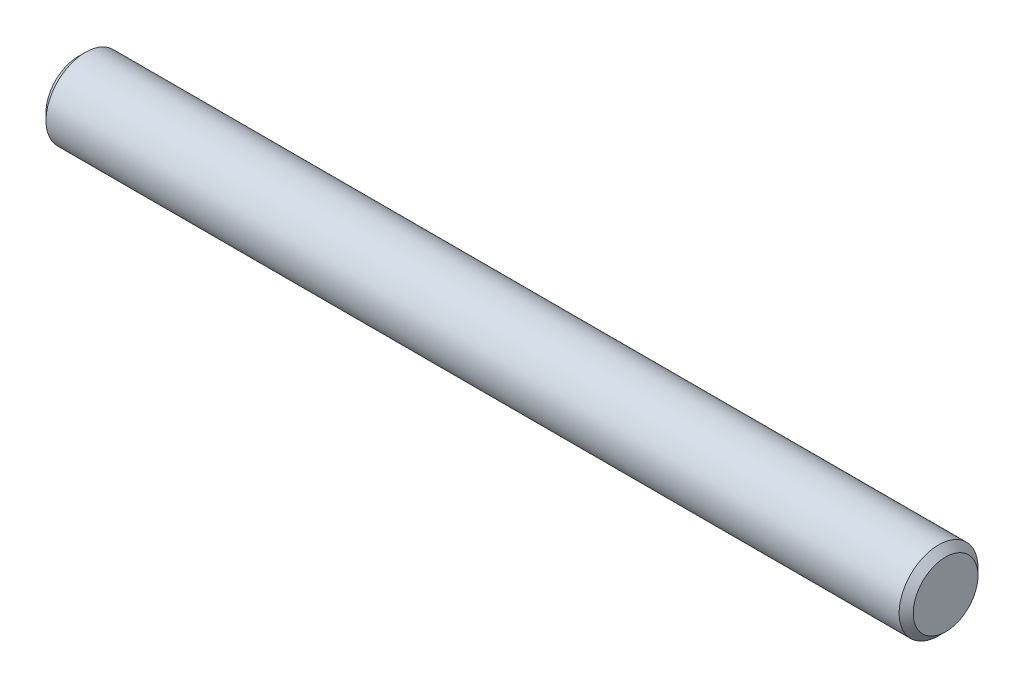
ISO-10303-21;
HEADER;
FILE_DESCRIPTION(('STEP AP214'),'2;1');
FILE_NAME('part.step','',(''),(''),'','','');
FILE_SCHEMA(('AUTOMOTIVE_DESIGN { 1 0 10303 214 1 1 1 1 }'));
ENDSEC;
DATA;
#1=APPLICATION_CONTEXT('core data for automotive mechanical design processes');
#2=APPLICATION_PROTOCOL_DEFINITION('international standard','automotive_design',2000,#1);
#3=PRODUCT_CONTEXT('',#1,'mechanical');
#4=PRODUCT('Part','Part','',(#3));
#5=PRODUCT_RELATED_PRODUCT_CATEGORY('part','',(#4));
#6=PRODUCT_DEFINITION_FORMATION('','',#4);
#7=PRODUCT_DEFINITION_CONTEXT('part definition',#1,'design');
#8=PRODUCT_DEFINITION('design','',#6,#7);
#9=PRODUCT_DEFINITION_SHAPE('','',#8);
#10=(LENGTH_UNIT() NAMED_UNIT(*) SI_UNIT(.MILLI.,.METRE.));
#11=(NAMED_UNIT(*) PLANE_ANGLE_UNIT() SI_UNIT($,.RADIAN.));
#12=(NAMED_UNIT(*) SI_UNIT($,.STERADIAN.) SOLID_ANGLE_UNIT());
#13=UNCERTAINTY_MEASURE_WITH_UNIT(LENGTH_MEASURE(1.E-05),#10,'distance_accuracy_value','');
#14=(GEOMETRIC_REPRESENTATION_CONTEXT(3) GLOBAL_UNCERTAINTY_ASSIGNED_CONTEXT((#13)) GLOBAL_UNIT_ASSIGNED_CONTEXT((#10,
#11,#12)) REPRESENTATION_CONTEXT('',''));
#15=CARTESIAN_POINT('',(0.,0.,0.));
#16=DIRECTION('',(0.,0.,1.));
#17=DIRECTION('',(1.,0.,0.));
#18=AXIS2_PLACEMENT_3D('',#15,#16,#17);
#19=CARTESIAN_POINT('',(0.,2.5,0.));
#20=DIRECTION('',(1.,0.,0.));
#21=DIRECTION('',(0.,0.,-1.));
#22=AXIS2_PLACEMENT_3D('',#19,#20,#21);
#23=PLANE('',#22);
#24=CARTESIAN_POINT('',(0.,0.,0.));
#25=DIRECTION('',(1.,0.,0.));
#26=DIRECTION('',(0.,0.,-1.));
#27=AXIS2_PLACEMENT_3D('',#24,#25,#26);
#28=CIRCLE('',#27,2.055);
#29=CARTESIAN_POINT('',(0.,0.,-2.055));
#30=VERTEX_POINT('',#29);
#31=EDGE_CURVE('E46',#30,#30,#28,.F.);
#32=ORIENTED_EDGE('',*,*,#31,.T.);
#33=EDGE_LOOP('',(#32));
#34=FACE_BOUND('',#33,.T.);
#35=ADVANCED_FACE('F31',(#34),#23,.F.);
#36=CARTESIAN_POINT('',(55.,2.5,0.));
#37=DIRECTION('',(1.,0.,0.));
#38=DIRECTION('',(0.,0.,-1.));
#39=AXIS2_PLACEMENT_3D('',#36,#37,#38);
#40=PLANE('',#39);
#41=CARTESIAN_POINT('',(55.,0.,0.));
#42=DIRECTION('',(1.,0.,0.));
#43=DIRECTION('',(0.,0.,-1.));
#44=AXIS2_PLACEMENT_3D('',#41,#42,#43);
#45=CIRCLE('',#44,2.055);
#46=CARTESIAN_POINT('',(55.,0.,-2.055));
#47=VERTEX_POINT('',#46);
#48=EDGE_CURVE('E11',#47,#47,#45,.T.);
#49=ORIENTED_EDGE('',*,*,#48,.T.);
#50=EDGE_LOOP('',(#49));
#51=FACE_BOUND('',#50,.T.);
#52=ADVANCED_FACE('F62',(#51),#40,.T.);
#53=CARTESIAN_POINT('',(-3.175,0.,0.));
#54=DIRECTION('',(-1.,0.,0.));
#55=DIRECTION('',(0.,0.,1.));
#56=AXIS2_PLACEMENT_3D('',#53,#54,#55);
#57=CYLINDRICAL_SURFACE('',#56,2.5);
#58=CARTESIAN_POINT('',(0.445000000000002,0.,0.));
#59=DIRECTION('',(1.,0.,0.));
#60=DIRECTION('',(0.,0.,-1.));
#61=AXIS2_PLACEMENT_3D('',#58,#59,#60);
#62=CIRCLE('',#61,2.5);
#63=CARTESIAN_POINT('',(0.445000000000002,0.,-2.5));
#64=VERTEX_POINT('',#63);
#65=EDGE_CURVE('E38',#64,#64,#62,.T.);
#66=ORIENTED_EDGE('',*,*,#65,.T.);
#67=EDGE_LOOP('',(#66));
#68=FACE_BOUND('',#67,.T.);
#69=CARTESIAN_POINT('',(54.555,0.,0.));
#70=DIRECTION('',(1.,0.,0.));
#71=DIRECTION('',(0.,0.,-1.));
#72=AXIS2_PLACEMENT_3D('',#69,#70,#71);
#73=CIRCLE('',#72,2.5);
#74=CARTESIAN_POINT('',(54.555,0.,-2.5));
#75=VERTEX_POINT('',#74);
#76=EDGE_CURVE('E42',#75,#75,#73,.F.);
#77=ORIENTED_EDGE('',*,*,#76,.T.);
#78=EDGE_LOOP('',(#77));
#79=FACE_BOUND('',#78,.T.);
#80=ADVANCED_FACE('F55',(#68,#79),#57,.T.);
#81=CARTESIAN_POINT('',(0.,0.,0.));
#82=DIRECTION('',(1.,0.,0.));
#83=DIRECTION('',(0.,0.,-1.));
#84=AXIS2_PLACEMENT_3D('',#81,#82,#83);
#85=CONICAL_SURFACE('',#84,2.055,0.785398163397446);
#86=ORIENTED_EDGE('',*,*,#65,.F.);
#87=EDGE_LOOP('',(#86));
#88=FACE_BOUND('',#87,.T.);
#89=ORIENTED_EDGE('',*,*,#31,.F.);
#90=EDGE_LOOP('',(#89));
#91=FACE_BOUND('',#90,.T.);
#92=ADVANCED_FACE('F53',(#88,#91),#85,.T.);
#93=CARTESIAN_POINT('',(54.555,0.,0.));
#94=DIRECTION('',(-1.,0.,0.));
#95=DIRECTION('',(0.,0.,1.));
#96=AXIS2_PLACEMENT_3D('',#93,#94,#95);
#97=CONICAL_SURFACE('',#96,2.5,0.785398163397448);
#98=ORIENTED_EDGE('',*,*,#48,.F.);
#99=EDGE_LOOP('',(#98));
#100=FACE_BOUND('',#99,.T.);
#101=ORIENTED_EDGE('',*,*,#76,.F.);
#102=EDGE_LOOP('',(#101));
#103=FACE_BOUND('',#102,.T.);
#104=ADVANCED_FACE('F33',(#100,#103),#97,.T.);
#105=CLOSED_SHELL('',(#35,#52,#80,#92,#104));
#106=MANIFOLD_SOLID_BREP('B2',#105);
#107=ADVANCED_BREP_SHAPE_REPRESENTATION('',(#18,#106),#14);
#108=SHAPE_DEFINITION_REPRESENTATION(#9,#107);
ENDSEC;
END-ISO-10303-21;
